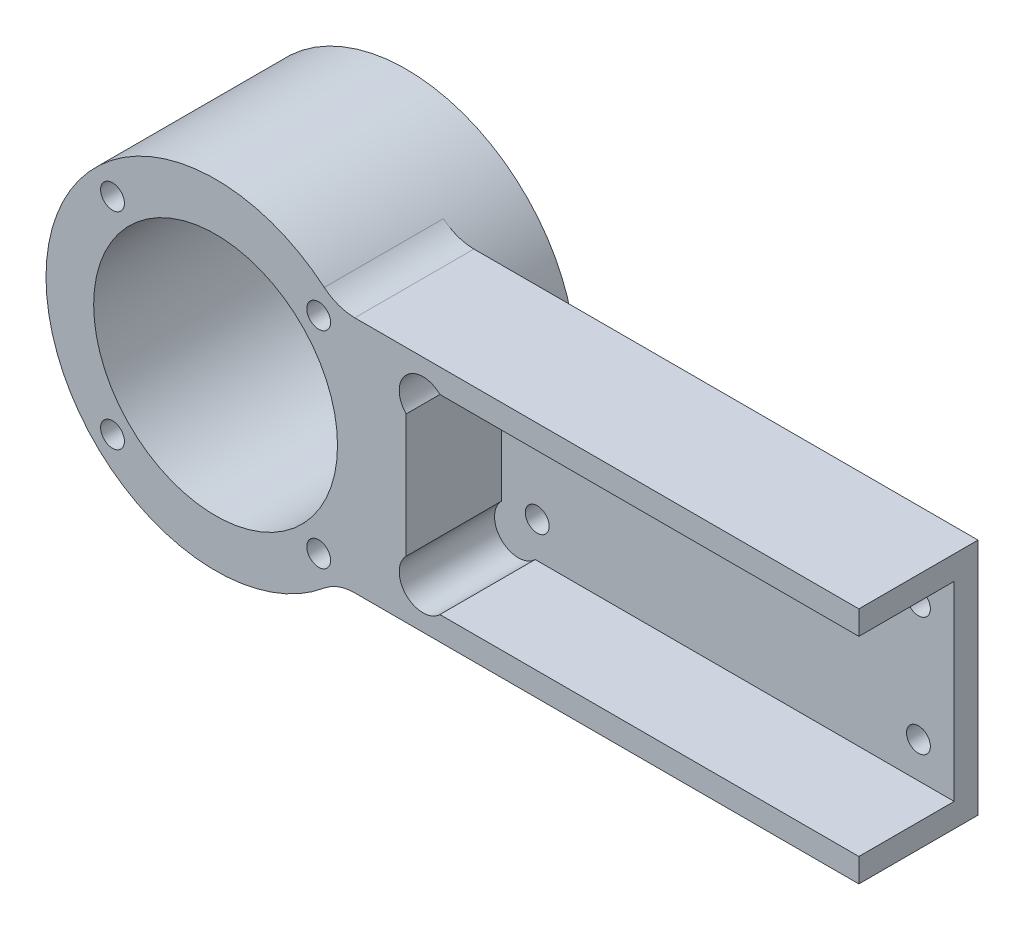
ISO-10303-21;
HEADER;
FILE_DESCRIPTION(('STEP AP214'),'2;1');
FILE_NAME('part.step','',(''),(''),'','','');
FILE_SCHEMA(('AUTOMOTIVE_DESIGN { 1 0 10303 214 1 1 1 1 }'));
ENDSEC;
DATA;
#1=APPLICATION_CONTEXT('core data for automotive mechanical design processes');
#2=APPLICATION_PROTOCOL_DEFINITION('international standard','automotive_design',2000,#1);
#3=PRODUCT_CONTEXT('',#1,'mechanical');
#4=PRODUCT('Part','Part','',(#3));
#5=PRODUCT_RELATED_PRODUCT_CATEGORY('part','',(#4));
#6=PRODUCT_DEFINITION_FORMATION('','',#4);
#7=PRODUCT_DEFINITION_CONTEXT('part definition',#1,'design');
#8=PRODUCT_DEFINITION('design','',#6,#7);
#9=PRODUCT_DEFINITION_SHAPE('','',#8);
#10=(LENGTH_UNIT() NAMED_UNIT(*) SI_UNIT(.MILLI.,.METRE.));
#11=(NAMED_UNIT(*) PLANE_ANGLE_UNIT() SI_UNIT($,.RADIAN.));
#12=(NAMED_UNIT(*) SI_UNIT($,.STERADIAN.) SOLID_ANGLE_UNIT());
#13=UNCERTAINTY_MEASURE_WITH_UNIT(LENGTH_MEASURE(1.E-05),#10,'distance_accuracy_value','');
#14=(GEOMETRIC_REPRESENTATION_CONTEXT(3) GLOBAL_UNCERTAINTY_ASSIGNED_CONTEXT((#13)) GLOBAL_UNIT_ASSIGNED_CONTEXT((#10,
#11,#12)) REPRESENTATION_CONTEXT('',''));
#15=CARTESIAN_POINT('',(0.,0.,0.));
#16=DIRECTION('',(0.,0.,1.));
#17=DIRECTION('',(1.,0.,0.));
#18=AXIS2_PLACEMENT_3D('',#15,#16,#17);
#19=CARTESIAN_POINT('',(0.,0.,6.35));
#20=DIRECTION('',(0.,0.,-1.));
#21=DIRECTION('',(-1.,0.,0.));
#22=AXIS2_PLACEMENT_3D('',#19,#20,#21);
#23=CYLINDRICAL_SURFACE('',#22,32.5);
#24=CARTESIAN_POINT('',(0.,0.,31.75));
#25=DIRECTION('',(0.,0.,1.));
#26=DIRECTION('',(1.,0.,0.));
#27=AXIS2_PLACEMENT_3D('',#24,#25,#26);
#28=CIRCLE('',#27,32.5);
#29=CARTESIAN_POINT('',(32.5,0.,31.75));
#30=VERTEX_POINT('',#29);
#31=EDGE_CURVE('E286',#30,#30,#28,.T.);
#32=ORIENTED_EDGE('',*,*,#31,.T.);
#33=EDGE_LOOP('',(#32));
#34=FACE_BOUND('',#33,.T.);
#35=CARTESIAN_POINT('',(0.,0.,-16.51));
#36=DIRECTION('',(0.,0.,-1.));
#37=DIRECTION('',(-1.,0.,0.));
#38=AXIS2_PLACEMENT_3D('',#35,#36,#37);
#39=CIRCLE('',#38,32.5);
#40=CARTESIAN_POINT('',(-32.5,0.,-16.51));
#41=VERTEX_POINT('',#40);
#42=EDGE_CURVE('E365',#41,#41,#39,.T.);
#43=ORIENTED_EDGE('',*,*,#42,.T.);
#44=EDGE_LOOP('',(#43));
#45=FACE_BOUND('',#44,.T.);
#46=ADVANCED_FACE('F69',(#34,#45),#23,.F.);
#47=CARTESIAN_POINT('',(0.,0.,0.));
#48=DIRECTION('',(0.,0.,1.));
#49=DIRECTION('',(1.,0.,0.));
#50=AXIS2_PLACEMENT_3D('',#47,#48,#49);
#51=PLANE('',#50);
#52=CARTESIAN_POINT('',(60.325,-15.875,0.));
#53=DIRECTION('',(0.,0.,1.));
#54=DIRECTION('',(1.,0.,0.));
#55=AXIS2_PLACEMENT_3D('',#52,#53,#54);
#56=CIRCLE('',#55,3.175);
#57=CARTESIAN_POINT('',(63.5,-15.875,0.));
#58=VERTEX_POINT('',#57);
#59=EDGE_CURVE('E325',#58,#58,#56,.T.);
#60=ORIENTED_EDGE('',*,*,#59,.T.);
#61=EDGE_LOOP('',(#60));
#62=FACE_BOUND('',#61,.T.);
#63=CARTESIAN_POINT('',(161.925,-15.875,0.));
#64=DIRECTION('',(0.,0.,1.));
#65=DIRECTION('',(1.,0.,0.));
#66=AXIS2_PLACEMENT_3D('',#63,#64,#65);
#67=CIRCLE('',#66,3.175);
#68=CARTESIAN_POINT('',(165.1,-15.875,0.));
#69=VERTEX_POINT('',#68);
#70=EDGE_CURVE('E321',#69,#69,#67,.T.);
#71=ORIENTED_EDGE('',*,*,#70,.T.);
#72=EDGE_LOOP('',(#71));
#73=FACE_BOUND('',#72,.T.);
#74=CARTESIAN_POINT('',(161.925,15.875,0.));
#75=DIRECTION('',(0.,0.,1.));
#76=DIRECTION('',(1.,0.,0.));
#77=AXIS2_PLACEMENT_3D('',#74,#75,#76);
#78=CIRCLE('',#77,3.175);
#79=CARTESIAN_POINT('',(165.1,15.875,0.));
#80=VERTEX_POINT('',#79);
#81=EDGE_CURVE('E324',#80,#80,#78,.T.);
#82=ORIENTED_EDGE('',*,*,#81,.T.);
#83=EDGE_LOOP('',(#82));
#84=FACE_BOUND('',#83,.T.);
#85=CARTESIAN_POINT('',(60.325,15.875,0.));
#86=DIRECTION('',(0.,0.,1.));
#87=DIRECTION('',(1.,0.,0.));
#88=AXIS2_PLACEMENT_3D('',#85,#86,#87);
#89=CIRCLE('',#88,3.175);
#90=CARTESIAN_POINT('',(63.5,15.875,0.));
#91=VERTEX_POINT('',#90);
#92=EDGE_CURVE('E328',#91,#91,#89,.T.);
#93=ORIENTED_EDGE('',*,*,#92,.T.);
#94=EDGE_LOOP('',(#93));
#95=FACE_BOUND('',#94,.T.);
#96=CARTESIAN_POINT('',(0.,0.,0.));
#97=DIRECTION('',(0.,0.,-1.));
#98=DIRECTION('',(-1.,0.,0.));
#99=AXIS2_PLACEMENT_3D('',#96,#97,#98);
#100=CIRCLE('',#99,45.2);
#101=CARTESIAN_POINT('',(28.9644266952946,34.7001727115717,0.));
#102=VERTEX_POINT('',#101);
#103=CARTESIAN_POINT('',(28.9644266952946,-34.7001727115717,0.));
#104=VERTEX_POINT('',#103);
#105=EDGE_CURVE('E155',#102,#104,#100,.T.);
#106=ORIENTED_EDGE('',*,*,#105,.F.);
#107=CARTESIAN_POINT('',(37.102661629592,44.45,0.));
#108=DIRECTION('',(0.,0.,1.));
#109=DIRECTION('',(1.,0.,0.));
#110=AXIS2_PLACEMENT_3D('',#107,#108,#109);
#111=CIRCLE('',#110,12.7);
#112=CARTESIAN_POINT('',(37.102661629592,31.75,0.));
#113=VERTEX_POINT('',#112);
#114=EDGE_CURVE('E77',#102,#113,#111,.T.);
#115=ORIENTED_EDGE('',*,*,#114,.T.);
#116=DIRECTION('',(1.,0.,0.));
#117=VECTOR('',#116,1.);
#118=CARTESIAN_POINT('',(0.,31.75,0.));
#119=LINE('',#118,#117);
#120=CARTESIAN_POINT('',(171.45,31.75,0.));
#121=VERTEX_POINT('',#120);
#122=EDGE_CURVE('E246',#113,#121,#119,.T.);
#123=ORIENTED_EDGE('',*,*,#122,.T.);
#124=DIRECTION('',(0.,1.,0.));
#125=VECTOR('',#124,1.);
#126=CARTESIAN_POINT('',(171.45,-7.49400541621981E-13,0.));
#127=LINE('',#126,#125);
#128=CARTESIAN_POINT('',(171.45,-31.75,0.));
#129=VERTEX_POINT('',#128);
#130=EDGE_CURVE('E241',#129,#121,#127,.T.);
#131=ORIENTED_EDGE('',*,*,#130,.F.);
#132=DIRECTION('',(1.,0.,0.));
#133=VECTOR('',#132,1.);
#134=CARTESIAN_POINT('',(0.,-31.75,0.));
#135=LINE('',#134,#133);
#136=CARTESIAN_POINT('',(37.102661629592,-31.75,0.));
#137=VERTEX_POINT('',#136);
#138=EDGE_CURVE('E249',#137,#129,#135,.T.);
#139=ORIENTED_EDGE('',*,*,#138,.F.);
#140=CARTESIAN_POINT('',(37.102661629592,-44.45,0.));
#141=DIRECTION('',(0.,0.,1.));
#142=DIRECTION('',(1.,0.,0.));
#143=AXIS2_PLACEMENT_3D('',#140,#141,#142);
#144=CIRCLE('',#143,12.7);
#145=EDGE_CURVE('E158',#137,#104,#144,.T.);
#146=ORIENTED_EDGE('',*,*,#145,.T.);
#147=EDGE_LOOP('',(#106,#115,#123,#131,#139,#146));
#148=FACE_BOUND('',#147,.T.);
#149=ADVANCED_FACE('F156',(#62,#73,#84,#95,#148),#51,.F.);
#150=CARTESIAN_POINT('',(171.45,-7.49400541621981E-13,6.35));
#151=DIRECTION('',(-1.,0.,0.));
#152=DIRECTION('',(0.,-1.,0.));
#153=AXIS2_PLACEMENT_3D('',#150,#151,#152);
#154=PLANE('',#153);
#155=ORIENTED_EDGE('',*,*,#130,.T.);
#156=DIRECTION('',(0.,0.,-1.));
#157=VECTOR('',#156,1.);
#158=CARTESIAN_POINT('',(171.45,31.75,6.35));
#159=LINE('',#158,#157);
#160=CARTESIAN_POINT('',(171.45,31.75,31.75));
#161=VERTEX_POINT('',#160);
#162=EDGE_CURVE('E244',#161,#121,#159,.T.);
#163=ORIENTED_EDGE('',*,*,#162,.F.);
#164=DIRECTION('',(0.,1.,0.));
#165=VECTOR('',#164,1.);
#166=CARTESIAN_POINT('',(171.45,7.49400541621981E-13,31.75));
#167=LINE('',#166,#165);
#168=CARTESIAN_POINT('',(171.45,25.4,31.75));
#169=VERTEX_POINT('',#168);
#170=EDGE_CURVE('E291',#169,#161,#167,.T.);
#171=ORIENTED_EDGE('',*,*,#170,.F.);
#172=DIRECTION('',(0.,0.,-1.));
#173=VECTOR('',#172,1.);
#174=CARTESIAN_POINT('',(171.45,25.4,31.75));
#175=LINE('',#174,#173);
#176=CARTESIAN_POINT('',(171.45,25.4,6.35));
#177=VERTEX_POINT('',#176);
#178=EDGE_CURVE('E252',#169,#177,#175,.T.);
#179=ORIENTED_EDGE('',*,*,#178,.T.);
#180=DIRECTION('',(0.,1.,0.));
#181=VECTOR('',#180,1.);
#182=CARTESIAN_POINT('',(171.45,-7.49400541621981E-13,6.35));
#183=LINE('',#182,#181);
#184=CARTESIAN_POINT('',(171.45,-25.4,6.35));
#185=VERTEX_POINT('',#184);
#186=EDGE_CURVE('E255',#185,#177,#183,.T.);
#187=ORIENTED_EDGE('',*,*,#186,.F.);
#188=DIRECTION('',(0.,0.,-1.));
#189=VECTOR('',#188,1.);
#190=CARTESIAN_POINT('',(171.45,-25.4,31.75));
#191=LINE('',#190,#189);
#192=CARTESIAN_POINT('',(171.45,-25.4,31.75));
#193=VERTEX_POINT('',#192);
#194=EDGE_CURVE('E247',#193,#185,#191,.T.);
#195=ORIENTED_EDGE('',*,*,#194,.F.);
#196=DIRECTION('',(0.,-1.,0.));
#197=VECTOR('',#196,1.);
#198=CARTESIAN_POINT('',(171.45,-7.49400541621981E-13,31.75));
#199=LINE('',#198,#197);
#200=CARTESIAN_POINT('',(171.45,-31.75,31.75));
#201=VERTEX_POINT('',#200);
#202=EDGE_CURVE('E201',#193,#201,#199,.T.);
#203=ORIENTED_EDGE('',*,*,#202,.T.);
#204=DIRECTION('',(0.,0.,-1.));
#205=VECTOR('',#204,1.);
#206=CARTESIAN_POINT('',(171.45,-31.75,6.35));
#207=LINE('',#206,#205);
#208=EDGE_CURVE('E200',#201,#129,#207,.T.);
#209=ORIENTED_EDGE('',*,*,#208,.T.);
#210=EDGE_LOOP('',(#155,#163,#171,#179,#187,#195,#203,#209));
#211=FACE_BOUND('',#210,.T.);
#212=ADVANCED_FACE('F221',(#211),#154,.F.);
#213=CARTESIAN_POINT('',(0.,31.75,6.35));
#214=DIRECTION('',(0.,1.,0.));
#215=DIRECTION('',(0.,0.,1.));
#216=AXIS2_PLACEMENT_3D('',#213,#214,#215);
#217=PLANE('',#216);
#218=ORIENTED_EDGE('',*,*,#122,.F.);
#219=DIRECTION('',(0.,0.,-1.));
#220=VECTOR('',#219,1.);
#221=CARTESIAN_POINT('',(37.102661629592,31.75,6.35));
#222=LINE('',#221,#220);
#223=CARTESIAN_POINT('',(37.102661629592,31.75,31.75));
#224=VERTEX_POINT('',#223);
#225=EDGE_CURVE('E84',#113,#224,#222,.F.);
#226=ORIENTED_EDGE('',*,*,#225,.T.);
#227=DIRECTION('',(-1.,0.,0.));
#228=VECTOR('',#227,1.);
#229=CARTESIAN_POINT('',(0.,31.75,31.75));
#230=LINE('',#229,#228);
#231=EDGE_CURVE('E284',#161,#224,#230,.T.);
#232=ORIENTED_EDGE('',*,*,#231,.F.);
#233=ORIENTED_EDGE('',*,*,#162,.T.);
#234=EDGE_LOOP('',(#218,#226,#232,#233));
#235=FACE_BOUND('',#234,.T.);
#236=ADVANCED_FACE('F233',(#235),#217,.T.);
#237=CARTESIAN_POINT('',(0.,0.,6.35));
#238=DIRECTION('',(0.,0.,-1.));
#239=DIRECTION('',(-1.,0.,0.));
#240=AXIS2_PLACEMENT_3D('',#237,#238,#239);
#241=CYLINDRICAL_SURFACE('',#240,45.2);
#242=DIRECTION('',(0.,0.,-1.));
#243=VECTOR('',#242,1.);
#244=CARTESIAN_POINT('',(28.9644266952946,34.7001727115717,6.35));
#245=LINE('',#244,#243);
#246=CARTESIAN_POINT('',(28.9644266952946,34.7001727115717,31.75));
#247=VERTEX_POINT('',#246);
#248=EDGE_CURVE('E168',#247,#102,#245,.T.);
#249=ORIENTED_EDGE('',*,*,#248,.T.);
#250=ORIENTED_EDGE('',*,*,#105,.T.);
#251=DIRECTION('',(0.,0.,-1.));
#252=VECTOR('',#251,1.);
#253=CARTESIAN_POINT('',(28.9644266952946,-34.7001727115717,6.35));
#254=LINE('',#253,#252);
#255=CARTESIAN_POINT('',(28.9644266952946,-34.7001727115717,31.75));
#256=VERTEX_POINT('',#255);
#257=EDGE_CURVE('E175',#104,#256,#254,.F.);
#258=ORIENTED_EDGE('',*,*,#257,.T.);
#259=CARTESIAN_POINT('',(0.,0.,31.75));
#260=DIRECTION('',(0.,0.,1.));
#261=DIRECTION('',(1.,0.,0.));
#262=AXIS2_PLACEMENT_3D('',#259,#260,#261);
#263=CIRCLE('',#262,45.2);
#264=EDGE_CURVE('E174',#247,#256,#263,.T.);
#265=ORIENTED_EDGE('',*,*,#264,.F.);
#266=EDGE_LOOP('',(#249,#250,#258,#265));
#267=FACE_BOUND('',#266,.T.);
#268=CARTESIAN_POINT('',(0.,0.,-19.05));
#269=DIRECTION('',(0.,0.,-1.));
#270=DIRECTION('',(-1.,0.,0.));
#271=AXIS2_PLACEMENT_3D('',#268,#269,#270);
#272=CIRCLE('',#271,45.2);
#273=CARTESIAN_POINT('',(-45.2,0.,-19.05));
#274=VERTEX_POINT('',#273);
#275=EDGE_CURVE('E162',#274,#274,#272,.T.);
#276=ORIENTED_EDGE('',*,*,#275,.F.);
#277=EDGE_LOOP('',(#276));
#278=FACE_BOUND('',#277,.T.);
#279=ADVANCED_FACE('F171',(#267,#278),#241,.T.);
#280=CARTESIAN_POINT('',(0.,-31.75,6.35));
#281=DIRECTION('',(0.,1.,0.));
#282=DIRECTION('',(0.,0.,1.));
#283=AXIS2_PLACEMENT_3D('',#280,#281,#282);
#284=PLANE('',#283);
#285=DIRECTION('',(-1.,0.,0.));
#286=VECTOR('',#285,1.);
#287=CARTESIAN_POINT('',(0.,-31.75,31.75));
#288=LINE('',#287,#286);
#289=CARTESIAN_POINT('',(37.102661629592,-31.75,31.75));
#290=VERTEX_POINT('',#289);
#291=EDGE_CURVE('E193',#201,#290,#288,.T.);
#292=ORIENTED_EDGE('',*,*,#291,.T.);
#293=DIRECTION('',(0.,0.,1.));
#294=VECTOR('',#293,1.);
#295=CARTESIAN_POINT('',(37.102661629592,-31.75,0.));
#296=LINE('',#295,#294);
#297=EDGE_CURVE('E176',#290,#137,#296,.F.);
#298=ORIENTED_EDGE('',*,*,#297,.T.);
#299=ORIENTED_EDGE('',*,*,#138,.T.);
#300=ORIENTED_EDGE('',*,*,#208,.F.);
#301=EDGE_LOOP('',(#292,#298,#299,#300));
#302=FACE_BOUND('',#301,.T.);
#303=ADVANCED_FACE('F198',(#302),#284,.F.);
#304=CARTESIAN_POINT('',(0.,0.,6.35));
#305=DIRECTION('',(0.,0.,1.));
#306=DIRECTION('',(1.,0.,0.));
#307=AXIS2_PLACEMENT_3D('',#304,#305,#306);
#308=PLANE('',#307);
#309=CARTESIAN_POINT('',(60.325,15.875,6.35));
#310=DIRECTION('',(0.,0.,1.));
#311=DIRECTION('',(1.,0.,0.));
#312=AXIS2_PLACEMENT_3D('',#309,#310,#311);
#313=CIRCLE('',#312,3.175);
#314=CARTESIAN_POINT('',(63.5,15.875,6.35));
#315=VERTEX_POINT('',#314);
#316=EDGE_CURVE('E305',#315,#315,#313,.T.);
#317=ORIENTED_EDGE('',*,*,#316,.F.);
#318=EDGE_LOOP('',(#317));
#319=FACE_BOUND('',#318,.T.);
#320=DIRECTION('',(0.,1.,0.));
#321=VECTOR('',#320,1.);
#322=CARTESIAN_POINT('',(50.8,0.,6.35));
#323=LINE('',#322,#321);
#324=CARTESIAN_POINT('',(50.8,-16.4197438789308,6.35));
#325=VERTEX_POINT('',#324);
#326=CARTESIAN_POINT('',(50.8,16.4197438789308,6.35));
#327=VERTEX_POINT('',#326);
#328=EDGE_CURVE('E270',#325,#327,#323,.T.);
#329=ORIENTED_EDGE('',*,*,#328,.F.);
#330=CARTESIAN_POINT('',(55.2901280605346,-20.9098719394654,6.35));
#331=DIRECTION('',(0.,0.,1.));
#332=DIRECTION('',(1.,0.,0.));
#333=AXIS2_PLACEMENT_3D('',#330,#331,#332);
#334=CIRCLE('',#333,6.35);
#335=CARTESIAN_POINT('',(59.7802561210692,-25.4,6.35));
#336=VERTEX_POINT('',#335);
#337=EDGE_CURVE('E277',#336,#325,#334,.F.);
#338=ORIENTED_EDGE('',*,*,#337,.F.);
#339=DIRECTION('',(-1.,0.,0.));
#340=VECTOR('',#339,1.);
#341=CARTESIAN_POINT('',(0.,-25.4,6.35));
#342=LINE('',#341,#340);
#343=EDGE_CURVE('E282',#185,#336,#342,.T.);
#344=ORIENTED_EDGE('',*,*,#343,.F.);
#345=ORIENTED_EDGE('',*,*,#186,.T.);
#346=DIRECTION('',(1.,0.,0.));
#347=VECTOR('',#346,1.);
#348=CARTESIAN_POINT('',(0.,25.4,6.35));
#349=LINE('',#348,#347);
#350=CARTESIAN_POINT('',(59.7802561210692,25.4,6.35));
#351=VERTEX_POINT('',#350);
#352=EDGE_CURVE('E281',#351,#177,#349,.T.);
#353=ORIENTED_EDGE('',*,*,#352,.F.);
#354=CARTESIAN_POINT('',(55.2901280605346,20.9098719394654,6.35));
#355=DIRECTION('',(0.,0.,1.));
#356=DIRECTION('',(1.,0.,0.));
#357=AXIS2_PLACEMENT_3D('',#354,#355,#356);
#358=CIRCLE('',#357,6.35);
#359=EDGE_CURVE('E280',#327,#351,#358,.F.);
#360=ORIENTED_EDGE('',*,*,#359,.F.);
#361=EDGE_LOOP('',(#329,#338,#344,#345,#353,#360));
#362=FACE_BOUND('',#361,.T.);
#363=CARTESIAN_POINT('',(60.325,-15.875,6.35));
#364=DIRECTION('',(0.,0.,1.));
#365=DIRECTION('',(1.,0.,0.));
#366=AXIS2_PLACEMENT_3D('',#363,#364,#365);
#367=CIRCLE('',#366,3.175);
#368=CARTESIAN_POINT('',(63.5,-15.875,6.35));
#369=VERTEX_POINT('',#368);
#370=EDGE_CURVE('E314',#369,#369,#367,.T.);
#371=ORIENTED_EDGE('',*,*,#370,.F.);
#372=EDGE_LOOP('',(#371));
#373=FACE_BOUND('',#372,.T.);
#374=CARTESIAN_POINT('',(161.925,15.875,6.35));
#375=DIRECTION('',(0.,0.,1.));
#376=DIRECTION('',(1.,0.,0.));
#377=AXIS2_PLACEMENT_3D('',#374,#375,#376);
#378=CIRCLE('',#377,3.175);
#379=CARTESIAN_POINT('',(165.1,15.875,6.35));
#380=VERTEX_POINT('',#379);
#381=EDGE_CURVE('E308',#380,#380,#378,.T.);
#382=ORIENTED_EDGE('',*,*,#381,.F.);
#383=EDGE_LOOP('',(#382));
#384=FACE_BOUND('',#383,.T.);
#385=CARTESIAN_POINT('',(161.925,-15.875,6.35));
#386=DIRECTION('',(0.,0.,1.));
#387=DIRECTION('',(1.,0.,0.));
#388=AXIS2_PLACEMENT_3D('',#385,#386,#387);
#389=CIRCLE('',#388,3.175);
#390=CARTESIAN_POINT('',(165.1,-15.875,6.35));
#391=VERTEX_POINT('',#390);
#392=EDGE_CURVE('E311',#391,#391,#389,.T.);
#393=ORIENTED_EDGE('',*,*,#392,.F.);
#394=EDGE_LOOP('',(#393));
#395=FACE_BOUND('',#394,.T.);
#396=ADVANCED_FACE('F230',(#319,#362,#373,#384,#395),#308,.T.);
#397=CARTESIAN_POINT('',(0.,0.,31.75));
#398=DIRECTION('',(0.,0.,1.));
#399=DIRECTION('',(1.,0.,0.));
#400=AXIS2_PLACEMENT_3D('',#397,#398,#399);
#401=PLANE('',#400);
#402=CARTESIAN_POINT('',(55.2901280605346,20.9098719394654,31.75));
#403=DIRECTION('',(0.,0.,1.));
#404=DIRECTION('',(1.,0.,0.));
#405=AXIS2_PLACEMENT_3D('',#402,#403,#404);
#406=CIRCLE('',#405,6.35);
#407=CARTESIAN_POINT('',(59.7802561210692,25.4,31.75));
#408=VERTEX_POINT('',#407);
#409=CARTESIAN_POINT('',(50.8,16.4197438789308,31.75));
#410=VERTEX_POINT('',#409);
#411=EDGE_CURVE('E347',#408,#410,#406,.T.);
#412=ORIENTED_EDGE('',*,*,#411,.F.);
#413=DIRECTION('',(1.,0.,0.));
#414=VECTOR('',#413,1.);
#415=CARTESIAN_POINT('',(0.,25.4,31.75));
#416=LINE('',#415,#414);
#417=EDGE_CURVE('E294',#408,#169,#416,.T.);
#418=ORIENTED_EDGE('',*,*,#417,.T.);
#419=ORIENTED_EDGE('',*,*,#170,.T.);
#420=ORIENTED_EDGE('',*,*,#231,.T.);
#421=CARTESIAN_POINT('',(37.102661629592,44.45,31.75));
#422=DIRECTION('',(0.,0.,1.));
#423=DIRECTION('',(1.,0.,0.));
#424=AXIS2_PLACEMENT_3D('',#421,#422,#423);
#425=CIRCLE('',#424,12.7);
#426=EDGE_CURVE('E12',#224,#247,#425,.F.);
#427=ORIENTED_EDGE('',*,*,#426,.T.);
#428=ORIENTED_EDGE('',*,*,#264,.T.);
#429=CARTESIAN_POINT('',(37.102661629592,-44.45,31.75));
#430=DIRECTION('',(0.,0.,1.));
#431=DIRECTION('',(1.,0.,0.));
#432=AXIS2_PLACEMENT_3D('',#429,#430,#431);
#433=CIRCLE('',#432,12.7);
#434=EDGE_CURVE('E169',#256,#290,#433,.F.);
#435=ORIENTED_EDGE('',*,*,#434,.T.);
#436=ORIENTED_EDGE('',*,*,#291,.F.);
#437=ORIENTED_EDGE('',*,*,#202,.F.);
#438=DIRECTION('',(-1.,0.,0.));
#439=VECTOR('',#438,1.);
#440=CARTESIAN_POINT('',(0.,-25.4,31.75));
#441=LINE('',#440,#439);
#442=CARTESIAN_POINT('',(59.7802561210692,-25.4,31.75));
#443=VERTEX_POINT('',#442);
#444=EDGE_CURVE('E298',#193,#443,#441,.T.);
#445=ORIENTED_EDGE('',*,*,#444,.T.);
#446=CARTESIAN_POINT('',(55.2901280605346,-20.9098719394654,31.75));
#447=DIRECTION('',(0.,0.,1.));
#448=DIRECTION('',(-1.,0.,0.));
#449=AXIS2_PLACEMENT_3D('',#446,#447,#448);
#450=CIRCLE('',#449,6.35);
#451=CARTESIAN_POINT('',(50.8,-16.4197438789308,31.75));
#452=VERTEX_POINT('',#451);
#453=EDGE_CURVE('E348',#452,#443,#450,.T.);
#454=ORIENTED_EDGE('',*,*,#453,.F.);
#455=DIRECTION('',(0.,1.,0.));
#456=VECTOR('',#455,1.);
#457=CARTESIAN_POINT('',(50.8,0.,31.75));
#458=LINE('',#457,#456);
#459=EDGE_CURVE('E272',#452,#410,#458,.T.);
#460=ORIENTED_EDGE('',*,*,#459,.T.);
#461=EDGE_LOOP('',(#412,#418,#419,#420,#427,#428,#435,#436,#437,#445,#454,#460));
#462=FACE_BOUND('',#461,.T.);
#463=CARTESIAN_POINT('',(-27.4710984490973,-27.4710984490974,31.75));
#464=DIRECTION('',(0.,0.,1.));
#465=DIRECTION('',(1.,0.,0.));
#466=AXIS2_PLACEMENT_3D('',#463,#464,#465);
#467=CIRCLE('',#466,3.175);
#468=CARTESIAN_POINT('',(-24.2960984490973,-27.4710984490974,31.75));
#469=VERTEX_POINT('',#468);
#470=EDGE_CURVE('E320',#469,#469,#467,.T.);
#471=ORIENTED_EDGE('',*,*,#470,.F.);
#472=EDGE_LOOP('',(#471));
#473=FACE_BOUND('',#472,.T.);
#474=CARTESIAN_POINT('',(27.4710984490973,27.4710984490974,31.75));
#475=DIRECTION('',(0.,0.,1.));
#476=DIRECTION('',(1.,0.,0.));
#477=AXIS2_PLACEMENT_3D('',#474,#475,#476);
#478=CIRCLE('',#477,3.175);
#479=CARTESIAN_POINT('',(30.6460984490973,27.4710984490974,31.75));
#480=VERTEX_POINT('',#479);
#481=EDGE_CURVE('E336',#480,#480,#478,.T.);
#482=ORIENTED_EDGE('',*,*,#481,.F.);
#483=EDGE_LOOP('',(#482));
#484=FACE_BOUND('',#483,.T.);
#485=CARTESIAN_POINT('',(-27.4710984490975,27.4710984490972,31.75));
#486=DIRECTION('',(0.,0.,1.));
#487=DIRECTION('',(1.,0.,0.));
#488=AXIS2_PLACEMENT_3D('',#485,#486,#487);
#489=CIRCLE('',#488,3.175);
#490=CARTESIAN_POINT('',(-24.2960984490975,27.4710984490972,31.75));
#491=VERTEX_POINT('',#490);
#492=EDGE_CURVE('E333',#491,#491,#489,.T.);
#493=ORIENTED_EDGE('',*,*,#492,.F.);
#494=EDGE_LOOP('',(#493));
#495=FACE_BOUND('',#494,.T.);
#496=CARTESIAN_POINT('',(27.4710984490975,-27.4710984490972,31.75));
#497=DIRECTION('',(0.,0.,1.));
#498=DIRECTION('',(1.,0.,0.));
#499=AXIS2_PLACEMENT_3D('',#496,#497,#498);
#500=CIRCLE('',#499,3.17500000000001);
#501=CARTESIAN_POINT('',(30.6460984490975,-27.4710984490972,31.75));
#502=VERTEX_POINT('',#501);
#503=EDGE_CURVE('E317',#502,#502,#500,.T.);
#504=ORIENTED_EDGE('',*,*,#503,.F.);
#505=EDGE_LOOP('',(#504));
#506=FACE_BOUND('',#505,.T.);
#507=ORIENTED_EDGE('',*,*,#31,.F.);
#508=EDGE_LOOP('',(#507));
#509=FACE_BOUND('',#508,.T.);
#510=ADVANCED_FACE('F190',(#462,#473,#484,#495,#506,#509),#401,.T.);
#511=CARTESIAN_POINT('',(0.,-25.4,31.75));
#512=DIRECTION('',(0.,-1.,0.));
#513=DIRECTION('',(0.,0.,-1.));
#514=AXIS2_PLACEMENT_3D('',#511,#512,#513);
#515=PLANE('',#514);
#516=ORIENTED_EDGE('',*,*,#343,.T.);
#517=DIRECTION('',(0.,0.,1.));
#518=VECTOR('',#517,1.);
#519=CARTESIAN_POINT('',(59.7802561210692,-25.4,-11.6105122421383));
#520=LINE('',#519,#518);
#521=EDGE_CURVE('E337',#336,#443,#520,.T.);
#522=ORIENTED_EDGE('',*,*,#521,.T.);
#523=ORIENTED_EDGE('',*,*,#444,.F.);
#524=ORIENTED_EDGE('',*,*,#194,.T.);
#525=EDGE_LOOP('',(#516,#522,#523,#524));
#526=FACE_BOUND('',#525,.T.);
#527=ADVANCED_FACE('F432',(#526),#515,.F.);
#528=CARTESIAN_POINT('',(50.8,0.,31.75));
#529=DIRECTION('',(-1.,0.,0.));
#530=DIRECTION('',(0.,0.,1.));
#531=AXIS2_PLACEMENT_3D('',#528,#529,#530);
#532=PLANE('',#531);
#533=ORIENTED_EDGE('',*,*,#328,.T.);
#534=DIRECTION('',(0.,0.,1.));
#535=VECTOR('',#534,1.);
#536=CARTESIAN_POINT('',(50.8,16.4197438789308,-11.6105122421383));
#537=LINE('',#536,#535);
#538=EDGE_CURVE('E344',#327,#410,#537,.T.);
#539=ORIENTED_EDGE('',*,*,#538,.T.);
#540=ORIENTED_EDGE('',*,*,#459,.F.);
#541=DIRECTION('',(0.,0.,1.));
#542=VECTOR('',#541,1.);
#543=CARTESIAN_POINT('',(50.8,-16.4197438789308,-11.6105122421383));
#544=LINE('',#543,#542);
#545=EDGE_CURVE('E180',#452,#325,#544,.F.);
#546=ORIENTED_EDGE('',*,*,#545,.T.);
#547=EDGE_LOOP('',(#533,#539,#540,#546));
#548=FACE_BOUND('',#547,.T.);
#549=ADVANCED_FACE('F268',(#548),#532,.F.);
#550=CARTESIAN_POINT('',(0.,25.4,31.75));
#551=DIRECTION('',(0.,1.,0.));
#552=DIRECTION('',(0.,0.,1.));
#553=AXIS2_PLACEMENT_3D('',#550,#551,#552);
#554=PLANE('',#553);
#555=ORIENTED_EDGE('',*,*,#417,.F.);
#556=DIRECTION('',(0.,0.,1.));
#557=VECTOR('',#556,1.);
#558=CARTESIAN_POINT('',(59.7802561210692,25.4,-11.6105122421383));
#559=LINE('',#558,#557);
#560=EDGE_CURVE('E260',#408,#351,#559,.F.);
#561=ORIENTED_EDGE('',*,*,#560,.T.);
#562=ORIENTED_EDGE('',*,*,#352,.T.);
#563=ORIENTED_EDGE('',*,*,#178,.F.);
#564=EDGE_LOOP('',(#555,#561,#562,#563));
#565=FACE_BOUND('',#564,.T.);
#566=ADVANCED_FACE('F428',(#565),#554,.F.);
#567=CARTESIAN_POINT('',(27.4710984490975,-27.4710984490972,0.));
#568=DIRECTION('',(0.,0.,1.));
#569=DIRECTION('',(1.,0.,0.));
#570=AXIS2_PLACEMENT_3D('',#567,#568,#569);
#571=CYLINDRICAL_SURFACE('',#570,3.17500000000001);
#572=ORIENTED_EDGE('',*,*,#503,.T.);
#573=EDGE_LOOP('',(#572));
#574=FACE_BOUND('',#573,.T.);
#575=CARTESIAN_POINT('',(27.4710984490975,-27.4710984490972,-19.05));
#576=DIRECTION('',(0.,0.,-1.));
#577=DIRECTION('',(-1.,0.,0.));
#578=AXIS2_PLACEMENT_3D('',#575,#576,#577);
#579=CIRCLE('',#578,3.17500000000001);
#580=CARTESIAN_POINT('',(24.2960984490975,-27.4710984490972,-19.05));
#581=VERTEX_POINT('',#580);
#582=EDGE_CURVE('E163',#581,#581,#579,.T.);
#583=ORIENTED_EDGE('',*,*,#582,.T.);
#584=EDGE_LOOP('',(#583));
#585=FACE_BOUND('',#584,.T.);
#586=ADVANCED_FACE('F411',(#574,#585),#571,.F.);
#587=CARTESIAN_POINT('',(-27.4710984490975,27.4710984490972,0.));
#588=DIRECTION('',(0.,0.,1.));
#589=DIRECTION('',(1.,0.,0.));
#590=AXIS2_PLACEMENT_3D('',#587,#588,#589);
#591=CYLINDRICAL_SURFACE('',#590,3.175);
#592=ORIENTED_EDGE('',*,*,#492,.T.);
#593=EDGE_LOOP('',(#592));
#594=FACE_BOUND('',#593,.T.);
#595=CARTESIAN_POINT('',(-27.4710984490975,27.4710984490972,-19.05));
#596=DIRECTION('',(0.,0.,-1.));
#597=DIRECTION('',(-1.,0.,0.));
#598=AXIS2_PLACEMENT_3D('',#595,#596,#597);
#599=CIRCLE('',#598,3.175);
#600=CARTESIAN_POINT('',(-30.6460984490975,27.4710984490972,-19.05));
#601=VERTEX_POINT('',#600);
#602=EDGE_CURVE('E359',#601,#601,#599,.T.);
#603=ORIENTED_EDGE('',*,*,#602,.T.);
#604=EDGE_LOOP('',(#603));
#605=FACE_BOUND('',#604,.T.);
#606=ADVANCED_FACE('F407',(#594,#605),#591,.F.);
#607=CARTESIAN_POINT('',(27.4710984490973,27.4710984490974,0.));
#608=DIRECTION('',(0.,0.,1.));
#609=DIRECTION('',(1.,0.,0.));
#610=AXIS2_PLACEMENT_3D('',#607,#608,#609);
#611=CYLINDRICAL_SURFACE('',#610,3.175);
#612=ORIENTED_EDGE('',*,*,#481,.T.);
#613=EDGE_LOOP('',(#612));
#614=FACE_BOUND('',#613,.T.);
#615=CARTESIAN_POINT('',(27.4710984490973,27.4710984490974,-19.05));
#616=DIRECTION('',(0.,0.,-1.));
#617=DIRECTION('',(-1.,0.,0.));
#618=AXIS2_PLACEMENT_3D('',#615,#616,#617);
#619=CIRCLE('',#618,3.175);
#620=CARTESIAN_POINT('',(24.2960984490973,27.4710984490974,-19.05));
#621=VERTEX_POINT('',#620);
#622=EDGE_CURVE('E362',#621,#621,#619,.T.);
#623=ORIENTED_EDGE('',*,*,#622,.T.);
#624=EDGE_LOOP('',(#623));
#625=FACE_BOUND('',#624,.T.);
#626=ADVANCED_FACE('F404',(#614,#625),#611,.F.);
#627=CARTESIAN_POINT('',(-27.4710984490973,-27.4710984490974,0.));
#628=DIRECTION('',(0.,0.,1.));
#629=DIRECTION('',(1.,0.,0.));
#630=AXIS2_PLACEMENT_3D('',#627,#628,#629);
#631=CYLINDRICAL_SURFACE('',#630,3.175);
#632=ORIENTED_EDGE('',*,*,#470,.T.);
#633=EDGE_LOOP('',(#632));
#634=FACE_BOUND('',#633,.T.);
#635=CARTESIAN_POINT('',(-27.4710984490973,-27.4710984490974,-19.05));
#636=DIRECTION('',(0.,0.,-1.));
#637=DIRECTION('',(-1.,0.,0.));
#638=AXIS2_PLACEMENT_3D('',#635,#636,#637);
#639=CIRCLE('',#638,3.175);
#640=CARTESIAN_POINT('',(-30.6460984490973,-27.4710984490974,-19.05));
#641=VERTEX_POINT('',#640);
#642=EDGE_CURVE('E356',#641,#641,#639,.T.);
#643=ORIENTED_EDGE('',*,*,#642,.T.);
#644=EDGE_LOOP('',(#643));
#645=FACE_BOUND('',#644,.T.);
#646=ADVANCED_FACE('F402',(#634,#645),#631,.F.);
#647=CARTESIAN_POINT('',(60.325,-15.875,0.));
#648=DIRECTION('',(0.,0.,1.));
#649=DIRECTION('',(1.,0.,0.));
#650=AXIS2_PLACEMENT_3D('',#647,#648,#649);
#651=CYLINDRICAL_SURFACE('',#650,3.175);
#652=ORIENTED_EDGE('',*,*,#370,.T.);
#653=EDGE_LOOP('',(#652));
#654=FACE_BOUND('',#653,.T.);
#655=ORIENTED_EDGE('',*,*,#59,.F.);
#656=EDGE_LOOP('',(#655));
#657=FACE_BOUND('',#656,.T.);
#658=ADVANCED_FACE('F398',(#654,#657),#651,.F.);
#659=CARTESIAN_POINT('',(161.925,-15.875,0.));
#660=DIRECTION('',(0.,0.,1.));
#661=DIRECTION('',(1.,0.,0.));
#662=AXIS2_PLACEMENT_3D('',#659,#660,#661);
#663=CYLINDRICAL_SURFACE('',#662,3.175);
#664=ORIENTED_EDGE('',*,*,#392,.T.);
#665=EDGE_LOOP('',(#664));
#666=FACE_BOUND('',#665,.T.);
#667=ORIENTED_EDGE('',*,*,#70,.F.);
#668=EDGE_LOOP('',(#667));
#669=FACE_BOUND('',#668,.T.);
#670=ADVANCED_FACE('F401',(#666,#669),#663,.F.);
#671=CARTESIAN_POINT('',(161.925,15.875,0.));
#672=DIRECTION('',(0.,0.,1.));
#673=DIRECTION('',(1.,0.,0.));
#674=AXIS2_PLACEMENT_3D('',#671,#672,#673);
#675=CYLINDRICAL_SURFACE('',#674,3.175);
#676=ORIENTED_EDGE('',*,*,#381,.T.);
#677=EDGE_LOOP('',(#676));
#678=FACE_BOUND('',#677,.T.);
#679=ORIENTED_EDGE('',*,*,#81,.F.);
#680=EDGE_LOOP('',(#679));
#681=FACE_BOUND('',#680,.T.);
#682=ADVANCED_FACE('F418',(#678,#681),#675,.F.);
#683=CARTESIAN_POINT('',(60.325,15.875,0.));
#684=DIRECTION('',(0.,0.,1.));
#685=DIRECTION('',(1.,0.,0.));
#686=AXIS2_PLACEMENT_3D('',#683,#684,#685);
#687=CYLINDRICAL_SURFACE('',#686,3.175);
#688=ORIENTED_EDGE('',*,*,#316,.T.);
#689=EDGE_LOOP('',(#688));
#690=FACE_BOUND('',#689,.T.);
#691=ORIENTED_EDGE('',*,*,#92,.F.);
#692=EDGE_LOOP('',(#691));
#693=FACE_BOUND('',#692,.T.);
#694=ADVANCED_FACE('F395',(#690,#693),#687,.F.);
#695=CARTESIAN_POINT('',(55.2901280605346,20.9098719394654,-11.6105122421383));
#696=DIRECTION('',(0.,0.,1.));
#697=DIRECTION('',(1.,0.,0.));
#698=AXIS2_PLACEMENT_3D('',#695,#696,#697);
#699=CYLINDRICAL_SURFACE('',#698,6.35);
#700=ORIENTED_EDGE('',*,*,#359,.T.);
#701=ORIENTED_EDGE('',*,*,#560,.F.);
#702=ORIENTED_EDGE('',*,*,#411,.T.);
#703=ORIENTED_EDGE('',*,*,#538,.F.);
#704=EDGE_LOOP('',(#700,#701,#702,#703));
#705=FACE_BOUND('',#704,.T.);
#706=ADVANCED_FACE('F211',(#705),#699,.F.);
#707=CARTESIAN_POINT('',(55.2901280605346,-20.9098719394654,-11.6105122421383));
#708=DIRECTION('',(0.,0.,1.));
#709=DIRECTION('',(1.,0.,0.));
#710=AXIS2_PLACEMENT_3D('',#707,#708,#709);
#711=CYLINDRICAL_SURFACE('',#710,6.35);
#712=ORIENTED_EDGE('',*,*,#337,.T.);
#713=ORIENTED_EDGE('',*,*,#545,.F.);
#714=ORIENTED_EDGE('',*,*,#453,.T.);
#715=ORIENTED_EDGE('',*,*,#521,.F.);
#716=EDGE_LOOP('',(#712,#713,#714,#715));
#717=FACE_BOUND('',#716,.T.);
#718=ADVANCED_FACE('F205',(#717),#711,.F.);
#719=CARTESIAN_POINT('',(37.102661629592,-44.45,6.35));
#720=DIRECTION('',(0.,0.,-1.));
#721=DIRECTION('',(-1.,0.,0.));
#722=AXIS2_PLACEMENT_3D('',#719,#720,#721);
#723=CYLINDRICAL_SURFACE('',#722,12.7);
#724=ORIENTED_EDGE('',*,*,#434,.F.);
#725=ORIENTED_EDGE('',*,*,#257,.F.);
#726=ORIENTED_EDGE('',*,*,#145,.F.);
#727=ORIENTED_EDGE('',*,*,#297,.F.);
#728=EDGE_LOOP('',(#724,#725,#726,#727));
#729=FACE_BOUND('',#728,.T.);
#730=ADVANCED_FACE('F203',(#729),#723,.F.);
#731=CARTESIAN_POINT('',(37.102661629592,44.45,6.35));
#732=DIRECTION('',(0.,0.,-1.));
#733=DIRECTION('',(-1.,0.,0.));
#734=AXIS2_PLACEMENT_3D('',#731,#732,#733);
#735=CYLINDRICAL_SURFACE('',#734,12.7);
#736=ORIENTED_EDGE('',*,*,#426,.F.);
#737=ORIENTED_EDGE('',*,*,#225,.F.);
#738=ORIENTED_EDGE('',*,*,#114,.F.);
#739=ORIENTED_EDGE('',*,*,#248,.F.);
#740=EDGE_LOOP('',(#736,#737,#738,#739));
#741=FACE_BOUND('',#740,.T.);
#742=ADVANCED_FACE('F71',(#741),#735,.F.);
#743=CARTESIAN_POINT('',(0.,0.,-19.05));
#744=DIRECTION('',(0.,0.,-1.));
#745=DIRECTION('',(-1.,0.,0.));
#746=AXIS2_PLACEMENT_3D('',#743,#744,#745);
#747=PLANE('',#746);
#748=ORIENTED_EDGE('',*,*,#622,.F.);
#749=EDGE_LOOP('',(#748));
#750=FACE_BOUND('',#749,.T.);
#751=ORIENTED_EDGE('',*,*,#642,.F.);
#752=EDGE_LOOP('',(#751));
#753=FACE_BOUND('',#752,.T.);
#754=ORIENTED_EDGE('',*,*,#275,.T.);
#755=EDGE_LOOP('',(#754));
#756=FACE_BOUND('',#755,.T.);
#757=ORIENTED_EDGE('',*,*,#582,.F.);
#758=EDGE_LOOP('',(#757));
#759=FACE_BOUND('',#758,.T.);
#760=ORIENTED_EDGE('',*,*,#602,.F.);
#761=EDGE_LOOP('',(#760));
#762=FACE_BOUND('',#761,.T.);
#763=CARTESIAN_POINT('',(0.,0.,-19.05));
#764=DIRECTION('',(0.,0.,-1.));
#765=DIRECTION('',(-1.,0.,0.));
#766=AXIS2_PLACEMENT_3D('',#763,#764,#765);
#767=CIRCLE('',#766,27.5);
#768=CARTESIAN_POINT('',(-27.5,0.,-19.05));
#769=VERTEX_POINT('',#768);
#770=EDGE_CURVE('E369',#769,#769,#767,.T.);
#771=ORIENTED_EDGE('',*,*,#770,.F.);
#772=EDGE_LOOP('',(#771));
#773=FACE_BOUND('',#772,.T.);
#774=ADVANCED_FACE('F210',(#750,#753,#756,#759,#762,#773),#747,.T.);
#775=CARTESIAN_POINT('',(0.,0.,-16.51));
#776=DIRECTION('',(0.,0.,-1.));
#777=DIRECTION('',(-1.,0.,0.));
#778=AXIS2_PLACEMENT_3D('',#775,#776,#777);
#779=PLANE('',#778);
#780=CARTESIAN_POINT('',(0.,0.,-16.51));
#781=DIRECTION('',(0.,0.,-1.));
#782=DIRECTION('',(-1.,0.,0.));
#783=AXIS2_PLACEMENT_3D('',#780,#781,#782);
#784=CIRCLE('',#783,27.5);
#785=CARTESIAN_POINT('',(-27.5,0.,-16.51));
#786=VERTEX_POINT('',#785);
#787=EDGE_CURVE('E368',#786,#786,#784,.T.);
#788=ORIENTED_EDGE('',*,*,#787,.T.);
#789=EDGE_LOOP('',(#788));
#790=FACE_BOUND('',#789,.T.);
#791=ORIENTED_EDGE('',*,*,#42,.F.);
#792=EDGE_LOOP('',(#791));
#793=FACE_BOUND('',#792,.T.);
#794=ADVANCED_FACE('F375',(#790,#793),#779,.F.);
#795=CARTESIAN_POINT('',(0.,0.,-16.51));
#796=DIRECTION('',(0.,0.,-1.));
#797=DIRECTION('',(-1.,0.,0.));
#798=AXIS2_PLACEMENT_3D('',#795,#796,#797);
#799=CYLINDRICAL_SURFACE('',#798,27.5);
#800=ORIENTED_EDGE('',*,*,#787,.F.);
#801=EDGE_LOOP('',(#800));
#802=FACE_BOUND('',#801,.T.);
#803=ORIENTED_EDGE('',*,*,#770,.T.);
#804=EDGE_LOOP('',(#803));
#805=FACE_BOUND('',#804,.T.);
#806=ADVANCED_FACE('F378',(#802,#805),#799,.F.);
#807=CLOSED_SHELL('',(#46,#149,#212,#236,#279,#303,#396,#510,#527,#549,#566,#586,#606,#626,#646,
#658,#670,#682,#694,#706,#718,#730,#742,#774,#794,#806));
#808=MANIFOLD_SOLID_BREP('B2',#807);
#809=ADVANCED_BREP_SHAPE_REPRESENTATION('',(#18,#808),#14);
#810=SHAPE_DEFINITION_REPRESENTATION(#9,#809);
ENDSEC;
END-ISO-10303-21;
